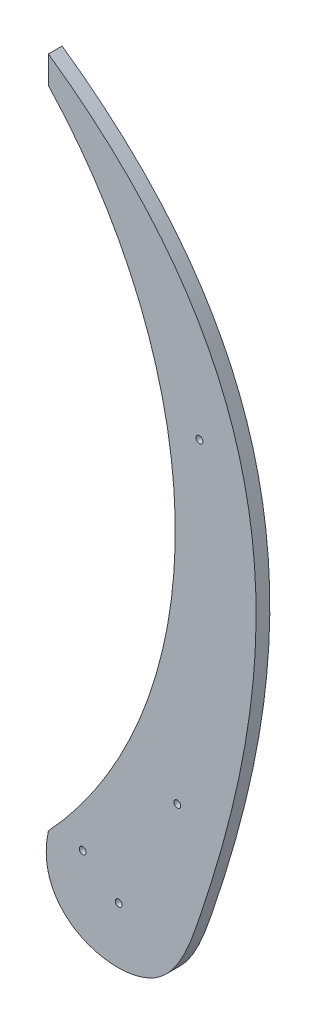
ISO-10303-21;
HEADER;
FILE_DESCRIPTION(('STEP AP214'),'2;1');
FILE_NAME('part.step','',(''),(''),'','','');
FILE_SCHEMA(('AUTOMOTIVE_DESIGN { 1 0 10303 214 1 1 1 1 }'));
ENDSEC;
DATA;
#1=APPLICATION_CONTEXT('core data for automotive mechanical design processes');
#2=APPLICATION_PROTOCOL_DEFINITION('international standard','automotive_design',2000,#1);
#3=PRODUCT_CONTEXT('',#1,'mechanical');
#4=PRODUCT('Part','Part','',(#3));
#5=PRODUCT_RELATED_PRODUCT_CATEGORY('part','',(#4));
#6=PRODUCT_DEFINITION_FORMATION('','',#4);
#7=PRODUCT_DEFINITION_CONTEXT('part definition',#1,'design');
#8=PRODUCT_DEFINITION('design','',#6,#7);
#9=PRODUCT_DEFINITION_SHAPE('','',#8);
#10=(LENGTH_UNIT() NAMED_UNIT(*) SI_UNIT(.MILLI.,.METRE.));
#11=(NAMED_UNIT(*) PLANE_ANGLE_UNIT() SI_UNIT($,.RADIAN.));
#12=(NAMED_UNIT(*) SI_UNIT($,.STERADIAN.) SOLID_ANGLE_UNIT());
#13=UNCERTAINTY_MEASURE_WITH_UNIT(LENGTH_MEASURE(1.E-05),#10,'distance_accuracy_value','');
#14=(GEOMETRIC_REPRESENTATION_CONTEXT(3) GLOBAL_UNCERTAINTY_ASSIGNED_CONTEXT((#13)) GLOBAL_UNIT_ASSIGNED_CONTEXT((#10,
#11,#12)) REPRESENTATION_CONTEXT('',''));
#15=CARTESIAN_POINT('',(0.,0.,0.));
#16=DIRECTION('',(0.,0.,1.));
#17=DIRECTION('',(1.,0.,0.));
#18=AXIS2_PLACEMENT_3D('',#15,#16,#17);
#19=CARTESIAN_POINT('',(150.313100488056,183.573108555513,10.));
#20=DIRECTION('',(0.,0.,-1.));
#21=DIRECTION('',(-1.,0.,0.));
#22=AXIS2_PLACEMENT_3D('',#19,#20,#21);
#23=PLANE('',#22);
#24=CARTESIAN_POINT('',(0.,0.,10.));
#25=CARTESIAN_POINT('',(-11.9512041989578,-54.5462654893662,10.));
#26=CARTESIAN_POINT('',(80.5486735293772,-82.1598087076309,10.));
#27=CARTESIAN_POINT('',(170.986519023576,164.60403212574,10.));
#28=CARTESIAN_POINT('',(184.12874957808,361.075064974928,10.));
#29=CARTESIAN_POINT('',(0.,490.,10.));
#30=B_SPLINE_CURVE_WITH_KNOTS('',3,(#24,#25,#26,#27,#28,#29),.UNSPECIFIED.,.F.,.F.,(4,1,1,4),
(0.,0.154451472311786,0.243976964830513,1.),.UNSPECIFIED.);
#31=CARTESIAN_POINT('',(0.,0.,10.));
#32=VERTEX_POINT('',#31);
#33=CARTESIAN_POINT('',(0.,490.,10.));
#34=VERTEX_POINT('',#33);
#35=EDGE_CURVE('E75',#32,#34,#30,.T.);
#36=ORIENTED_EDGE('',*,*,#35,.T.);
#37=DIRECTION('',(0.,-1.,0.));
#38=VECTOR('',#37,1.);
#39=CARTESIAN_POINT('',(0.,490.,10.));
#40=LINE('',#39,#38);
#41=CARTESIAN_POINT('',(0.,470.,10.));
#42=VERTEX_POINT('',#41);
#43=EDGE_CURVE('E71',#34,#42,#40,.T.);
#44=ORIENTED_EDGE('',*,*,#43,.T.);
#45=CARTESIAN_POINT('',(-252.586618806302,235.,10.));
#46=DIRECTION('',(0.,0.,-1.));
#47=DIRECTION('',(1.,0.,0.));
#48=AXIS2_PLACEMENT_3D('',#45,#46,#47);
#49=CIRCLE('',#48,345.);
#50=EDGE_CURVE('E51',#42,#32,#49,.T.);
#51=ORIENTED_EDGE('',*,*,#50,.T.);
#52=EDGE_LOOP('',(#36,#44,#51));
#53=FACE_BOUND('',#52,.T.);
#54=CARTESIAN_POINT('',(93.8971635837333,63.8089798881083,10.));
#55=DIRECTION('',(0.,0.,1.));
#56=DIRECTION('',(1.,0.,0.));
#57=AXIS2_PLACEMENT_3D('',#54,#55,#56);
#58=CIRCLE('',#57,2.5);
#59=CARTESIAN_POINT('',(96.3971635837333,63.8089798881083,10.));
#60=VERTEX_POINT('',#59);
#61=EDGE_CURVE('E84',#60,#60,#58,.T.);
#62=ORIENTED_EDGE('',*,*,#61,.F.);
#63=EDGE_LOOP('',(#62));
#64=FACE_BOUND('',#63,.T.);
#65=CARTESIAN_POINT('',(25.,0.,10.));
#66=DIRECTION('',(0.,0.,1.));
#67=DIRECTION('',(1.,0.,0.));
#68=AXIS2_PLACEMENT_3D('',#65,#66,#67);
#69=CIRCLE('',#68,2.5);
#70=CARTESIAN_POINT('',(27.5,0.,10.));
#71=VERTEX_POINT('',#70);
#72=EDGE_CURVE('E123',#71,#71,#69,.T.);
#73=ORIENTED_EDGE('',*,*,#72,.F.);
#74=EDGE_LOOP('',(#73));
#75=FACE_BOUND('',#74,.T.);
#76=CARTESIAN_POINT('',(51.234753829798,-20.,10.));
#77=DIRECTION('',(0.,0.,1.));
#78=DIRECTION('',(1.,0.,0.));
#79=AXIS2_PLACEMENT_3D('',#76,#77,#78);
#80=CIRCLE('',#79,2.5);
#81=CARTESIAN_POINT('',(53.734753829798,-20.,10.));
#82=VERTEX_POINT('',#81);
#83=EDGE_CURVE('E118',#82,#82,#80,.T.);
#84=ORIENTED_EDGE('',*,*,#83,.F.);
#85=EDGE_LOOP('',(#84));
#86=FACE_BOUND('',#85,.T.);
#87=CARTESIAN_POINT('',(110.,301.71595540587,10.));
#88=DIRECTION('',(0.,0.,1.));
#89=DIRECTION('',(1.,0.,0.));
#90=AXIS2_PLACEMENT_3D('',#87,#88,#89);
#91=CIRCLE('',#90,2.50000000000001);
#92=CARTESIAN_POINT('',(112.5,301.71595540587,10.));
#93=VERTEX_POINT('',#92);
#94=EDGE_CURVE('E112',#93,#93,#91,.T.);
#95=ORIENTED_EDGE('',*,*,#94,.F.);
#96=EDGE_LOOP('',(#95));
#97=FACE_BOUND('',#96,.T.);
#98=ADVANCED_FACE('F33',(#53,#64,#75,#86,#97),#23,.F.);
#99=CARTESIAN_POINT('',(150.313100488056,183.573108555513,0.));
#100=DIRECTION('',(0.,0.,-1.));
#101=DIRECTION('',(-1.,0.,0.));
#102=AXIS2_PLACEMENT_3D('',#99,#100,#101);
#103=PLANE('',#102);
#104=CARTESIAN_POINT('',(51.234753829798,-20.,0.));
#105=DIRECTION('',(0.,0.,1.));
#106=DIRECTION('',(1.,0.,0.));
#107=AXIS2_PLACEMENT_3D('',#104,#105,#106);
#108=CIRCLE('',#107,2.5);
#109=CARTESIAN_POINT('',(53.734753829798,-20.,0.));
#110=VERTEX_POINT('',#109);
#111=EDGE_CURVE('E115',#110,#110,#108,.T.);
#112=ORIENTED_EDGE('',*,*,#111,.T.);
#113=EDGE_LOOP('',(#112));
#114=FACE_BOUND('',#113,.T.);
#115=CARTESIAN_POINT('',(93.8971635837333,63.8089798881083,0.));
#116=DIRECTION('',(0.,0.,1.));
#117=DIRECTION('',(1.,0.,0.));
#118=AXIS2_PLACEMENT_3D('',#115,#116,#117);
#119=CIRCLE('',#118,2.5);
#120=CARTESIAN_POINT('',(96.3971635837333,63.8089798881083,0.));
#121=VERTEX_POINT('',#120);
#122=EDGE_CURVE('E88',#121,#121,#119,.T.);
#123=ORIENTED_EDGE('',*,*,#122,.T.);
#124=EDGE_LOOP('',(#123));
#125=FACE_BOUND('',#124,.T.);
#126=CARTESIAN_POINT('',(0.,0.,0.));
#127=CARTESIAN_POINT('',(-11.9512041989578,-54.5462654893662,0.));
#128=CARTESIAN_POINT('',(80.5486735293772,-82.1598087076309,0.));
#129=CARTESIAN_POINT('',(170.986519023576,164.60403212574,0.));
#130=CARTESIAN_POINT('',(184.12874957808,361.075064974928,0.));
#131=CARTESIAN_POINT('',(0.,490.,0.));
#132=B_SPLINE_CURVE_WITH_KNOTS('',3,(#126,#127,#128,#129,#130,#131),.UNSPECIFIED.,.F.,.F.,(4,1,
1,4),(0.,0.154451472311786,0.243976964830513,1.),.UNSPECIFIED.);
#133=CARTESIAN_POINT('',(0.,0.,0.));
#134=VERTEX_POINT('',#133);
#135=CARTESIAN_POINT('',(0.,490.,0.));
#136=VERTEX_POINT('',#135);
#137=EDGE_CURVE('E81',#134,#136,#132,.T.);
#138=ORIENTED_EDGE('',*,*,#137,.F.);
#139=CARTESIAN_POINT('',(-252.586618806302,235.,0.));
#140=DIRECTION('',(0.,0.,-1.));
#141=DIRECTION('',(1.,0.,0.));
#142=AXIS2_PLACEMENT_3D('',#139,#140,#141);
#143=CIRCLE('',#142,345.);
#144=CARTESIAN_POINT('',(0.,470.,0.));
#145=VERTEX_POINT('',#144);
#146=EDGE_CURVE('E68',#145,#134,#143,.T.);
#147=ORIENTED_EDGE('',*,*,#146,.F.);
#148=DIRECTION('',(0.,-1.,0.));
#149=VECTOR('',#148,1.);
#150=CARTESIAN_POINT('',(0.,490.,0.));
#151=LINE('',#150,#149);
#152=EDGE_CURVE('E63',#136,#145,#151,.T.);
#153=ORIENTED_EDGE('',*,*,#152,.F.);
#154=EDGE_LOOP('',(#138,#147,#153));
#155=FACE_BOUND('',#154,.T.);
#156=CARTESIAN_POINT('',(25.,0.,0.));
#157=DIRECTION('',(0.,0.,1.));
#158=DIRECTION('',(1.,0.,0.));
#159=AXIS2_PLACEMENT_3D('',#156,#157,#158);
#160=CIRCLE('',#159,2.5);
#161=CARTESIAN_POINT('',(27.5,0.,0.));
#162=VERTEX_POINT('',#161);
#163=EDGE_CURVE('E107',#162,#162,#160,.T.);
#164=ORIENTED_EDGE('',*,*,#163,.T.);
#165=EDGE_LOOP('',(#164));
#166=FACE_BOUND('',#165,.T.);
#167=CARTESIAN_POINT('',(110.,301.71595540587,0.));
#168=DIRECTION('',(0.,0.,1.));
#169=DIRECTION('',(1.,0.,0.));
#170=AXIS2_PLACEMENT_3D('',#167,#168,#169);
#171=CIRCLE('',#170,2.50000000000001);
#172=CARTESIAN_POINT('',(112.5,301.71595540587,0.));
#173=VERTEX_POINT('',#172);
#174=EDGE_CURVE('E110',#173,#173,#171,.T.);
#175=ORIENTED_EDGE('',*,*,#174,.T.);
#176=EDGE_LOOP('',(#175));
#177=FACE_BOUND('',#176,.T.);
#178=ADVANCED_FACE('F99',(#114,#125,#155,#166,#177),#103,.T.);
#179=DIRECTION('',(0.,0.,-1.));
#180=VECTOR('',#179,1.);
#181=SURFACE_OF_LINEAR_EXTRUSION('',#30,#180);
#182=ORIENTED_EDGE('',*,*,#137,.T.);
#183=DIRECTION('',(0.,0.,-1.));
#184=VECTOR('',#183,1.);
#185=CARTESIAN_POINT('',(0.,490.,10.));
#186=LINE('',#185,#184);
#187=EDGE_CURVE('E11',#34,#136,#186,.T.);
#188=ORIENTED_EDGE('',*,*,#187,.F.);
#189=ORIENTED_EDGE('',*,*,#35,.F.);
#190=DIRECTION('',(0.,0.,-1.));
#191=VECTOR('',#190,1.);
#192=CARTESIAN_POINT('',(0.,0.,10.));
#193=LINE('',#192,#191);
#194=EDGE_CURVE('E82',#32,#134,#193,.T.);
#195=ORIENTED_EDGE('',*,*,#194,.T.);
#196=EDGE_LOOP('',(#182,#188,#189,#195));
#197=FACE_BOUND('',#196,.T.);
#198=ADVANCED_FACE('F35',(#197),#181,.F.);
#199=CARTESIAN_POINT('',(0.,490.,10.));
#200=DIRECTION('',(1.,0.,0.));
#201=DIRECTION('',(0.,0.,-1.));
#202=AXIS2_PLACEMENT_3D('',#199,#200,#201);
#203=PLANE('',#202);
#204=ORIENTED_EDGE('',*,*,#152,.T.);
#205=DIRECTION('',(0.,0.,-1.));
#206=VECTOR('',#205,1.);
#207=CARTESIAN_POINT('',(0.,470.,10.));
#208=LINE('',#207,#206);
#209=EDGE_CURVE('E43',#42,#145,#208,.T.);
#210=ORIENTED_EDGE('',*,*,#209,.F.);
#211=ORIENTED_EDGE('',*,*,#43,.F.);
#212=ORIENTED_EDGE('',*,*,#187,.T.);
#213=EDGE_LOOP('',(#204,#210,#211,#212));
#214=FACE_BOUND('',#213,.T.);
#215=ADVANCED_FACE('F72',(#214),#203,.F.);
#216=CARTESIAN_POINT('',(-252.586618806302,235.,10.));
#217=DIRECTION('',(0.,0.,-1.));
#218=DIRECTION('',(-1.,0.,0.));
#219=AXIS2_PLACEMENT_3D('',#216,#217,#218);
#220=CYLINDRICAL_SURFACE('',#219,345.);
#221=ORIENTED_EDGE('',*,*,#146,.T.);
#222=ORIENTED_EDGE('',*,*,#194,.F.);
#223=ORIENTED_EDGE('',*,*,#50,.F.);
#224=ORIENTED_EDGE('',*,*,#209,.T.);
#225=EDGE_LOOP('',(#221,#222,#223,#224));
#226=FACE_BOUND('',#225,.T.);
#227=ADVANCED_FACE('F98',(#226),#220,.F.);
#228=CARTESIAN_POINT('',(93.8971635837333,63.8089798881083,10.));
#229=DIRECTION('',(0.,0.,-1.));
#230=DIRECTION('',(-1.,0.,0.));
#231=AXIS2_PLACEMENT_3D('',#228,#229,#230);
#232=CYLINDRICAL_SURFACE('',#231,2.5);
#233=ORIENTED_EDGE('',*,*,#61,.T.);
#234=EDGE_LOOP('',(#233));
#235=FACE_BOUND('',#234,.T.);
#236=ORIENTED_EDGE('',*,*,#122,.F.);
#237=EDGE_LOOP('',(#236));
#238=FACE_BOUND('',#237,.T.);
#239=ADVANCED_FACE('F137',(#235,#238),#232,.F.);
#240=CARTESIAN_POINT('',(25.,0.,10.));
#241=DIRECTION('',(0.,0.,-1.));
#242=DIRECTION('',(-1.,0.,0.));
#243=AXIS2_PLACEMENT_3D('',#240,#241,#242);
#244=CYLINDRICAL_SURFACE('',#243,2.5);
#245=ORIENTED_EDGE('',*,*,#72,.T.);
#246=EDGE_LOOP('',(#245));
#247=FACE_BOUND('',#246,.T.);
#248=ORIENTED_EDGE('',*,*,#163,.F.);
#249=EDGE_LOOP('',(#248));
#250=FACE_BOUND('',#249,.T.);
#251=ADVANCED_FACE('F139',(#247,#250),#244,.F.);
#252=CARTESIAN_POINT('',(51.234753829798,-20.,10.));
#253=DIRECTION('',(0.,0.,-1.));
#254=DIRECTION('',(-1.,0.,0.));
#255=AXIS2_PLACEMENT_3D('',#252,#253,#254);
#256=CYLINDRICAL_SURFACE('',#255,2.5);
#257=ORIENTED_EDGE('',*,*,#83,.T.);
#258=EDGE_LOOP('',(#257));
#259=FACE_BOUND('',#258,.T.);
#260=ORIENTED_EDGE('',*,*,#111,.F.);
#261=EDGE_LOOP('',(#260));
#262=FACE_BOUND('',#261,.T.);
#263=ADVANCED_FACE('F146',(#259,#262),#256,.F.);
#264=CARTESIAN_POINT('',(110.,301.71595540587,10.));
#265=DIRECTION('',(0.,0.,-1.));
#266=DIRECTION('',(-1.,0.,0.));
#267=AXIS2_PLACEMENT_3D('',#264,#265,#266);
#268=CYLINDRICAL_SURFACE('',#267,2.50000000000001);
#269=ORIENTED_EDGE('',*,*,#94,.T.);
#270=EDGE_LOOP('',(#269));
#271=FACE_BOUND('',#270,.T.);
#272=ORIENTED_EDGE('',*,*,#174,.F.);
#273=EDGE_LOOP('',(#272));
#274=FACE_BOUND('',#273,.T.);
#275=ADVANCED_FACE('F198',(#271,#274),#268,.F.);
#276=CLOSED_SHELL('',(#98,#178,#198,#215,#227,#239,#251,#263,#275));
#277=MANIFOLD_SOLID_BREP('B2',#276);
#278=ADVANCED_BREP_SHAPE_REPRESENTATION('',(#18,#277),#14);
#279=SHAPE_DEFINITION_REPRESENTATION(#9,#278);
ENDSEC;
END-ISO-10303-21;
